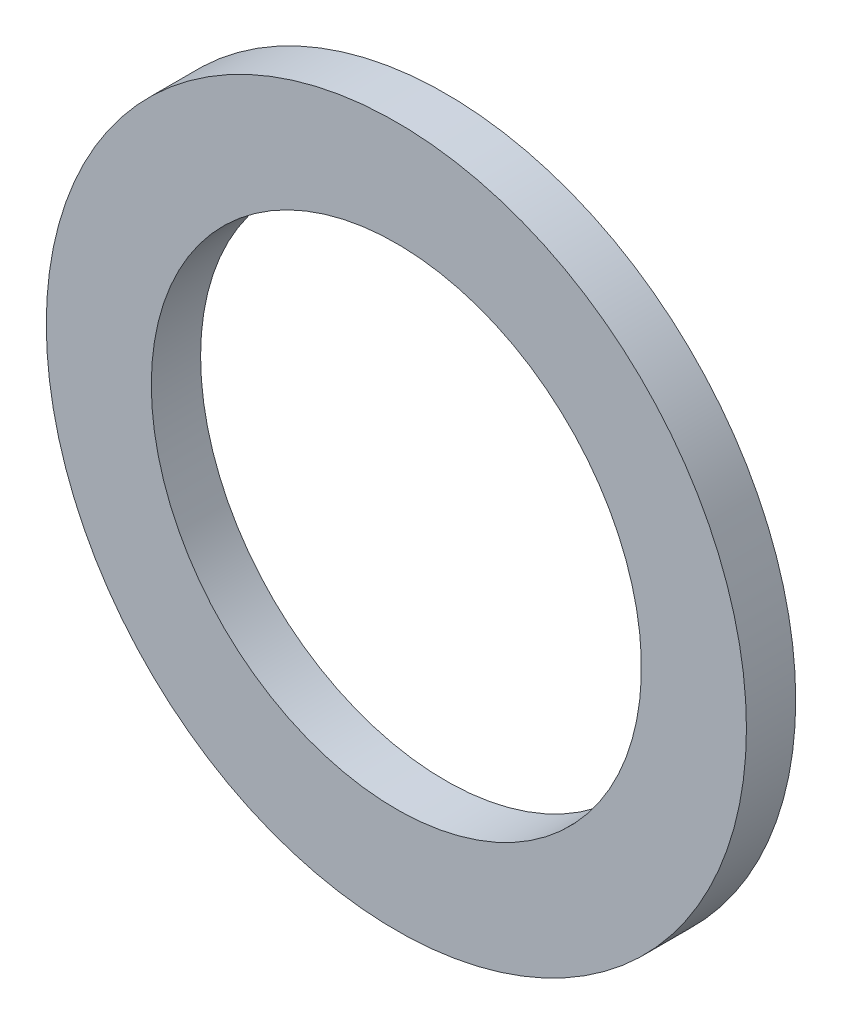
ISO-10303-21;
HEADER;
FILE_DESCRIPTION(('STEP AP214'),'2;1');
FILE_NAME('part.step','',(''),(''),'','','');
FILE_SCHEMA(('AUTOMOTIVE_DESIGN { 1 0 10303 214 1 1 1 1 }'));
ENDSEC;
DATA;
#1=APPLICATION_CONTEXT('core data for automotive mechanical design processes');
#2=APPLICATION_PROTOCOL_DEFINITION('international standard','automotive_design',2000,#1);
#3=PRODUCT_CONTEXT('',#1,'mechanical');
#4=PRODUCT('Part','Part','',(#3));
#5=PRODUCT_RELATED_PRODUCT_CATEGORY('part','',(#4));
#6=PRODUCT_DEFINITION_FORMATION('','',#4);
#7=PRODUCT_DEFINITION_CONTEXT('part definition',#1,'design');
#8=PRODUCT_DEFINITION('design','',#6,#7);
#9=PRODUCT_DEFINITION_SHAPE('','',#8);
#10=(LENGTH_UNIT() NAMED_UNIT(*) SI_UNIT(.MILLI.,.METRE.));
#11=(NAMED_UNIT(*) PLANE_ANGLE_UNIT() SI_UNIT($,.RADIAN.));
#12=(NAMED_UNIT(*) SI_UNIT($,.STERADIAN.) SOLID_ANGLE_UNIT());
#13=UNCERTAINTY_MEASURE_WITH_UNIT(LENGTH_MEASURE(1.E-05),#10,'distance_accuracy_value','');
#14=(GEOMETRIC_REPRESENTATION_CONTEXT(3) GLOBAL_UNCERTAINTY_ASSIGNED_CONTEXT((#13)) GLOBAL_UNIT_ASSIGNED_CONTEXT((#10,
#11,#12)) REPRESENTATION_CONTEXT('',''));
#15=CARTESIAN_POINT('',(0.,0.,0.));
#16=DIRECTION('',(0.,0.,1.));
#17=DIRECTION('',(1.,0.,0.));
#18=AXIS2_PLACEMENT_3D('',#15,#16,#17);
#19=CARTESIAN_POINT('',(0.,0.,-0.5588));
#20=DIRECTION('',(0.,0.,1.));
#21=DIRECTION('',(1.,0.,0.));
#22=AXIS2_PLACEMENT_3D('',#19,#20,#21);
#23=PLANE('',#22);
#24=CARTESIAN_POINT('',(0.,0.,-0.5588));
#25=DIRECTION('',(0.,0.,-1.));
#26=DIRECTION('',(-1.,0.,0.));
#27=AXIS2_PLACEMENT_3D('',#24,#25,#26);
#28=CIRCLE('',#27,5.55625);
#29=CARTESIAN_POINT('',(-5.55625,0.,-0.5588));
#30=VERTEX_POINT('',#29);
#31=EDGE_CURVE('E27',#30,#30,#28,.F.);
#32=ORIENTED_EDGE('',*,*,#31,.T.);
#33=EDGE_LOOP('',(#32));
#34=FACE_BOUND('',#33,.T.);
#35=CARTESIAN_POINT('',(0.,0.,-0.5588));
#36=DIRECTION('',(0.,0.,-1.));
#37=DIRECTION('',(-1.,0.,0.));
#38=AXIS2_PLACEMENT_3D('',#35,#36,#37);
#39=CIRCLE('',#38,7.9375);
#40=CARTESIAN_POINT('',(-7.9375,0.,-0.5588));
#41=VERTEX_POINT('',#40);
#42=EDGE_CURVE('E18',#41,#41,#39,.F.);
#43=ORIENTED_EDGE('',*,*,#42,.F.);
#44=EDGE_LOOP('',(#43));
#45=FACE_BOUND('',#44,.T.);
#46=ADVANCED_FACE('F15',(#34,#45),#23,.F.);
#47=CARTESIAN_POINT('',(0.,0.,0.5588));
#48=DIRECTION('',(0.,0.,-1.));
#49=DIRECTION('',(-1.,0.,0.));
#50=AXIS2_PLACEMENT_3D('',#47,#48,#49);
#51=CYLINDRICAL_SURFACE('',#50,7.9375);
#52=ORIENTED_EDGE('',*,*,#42,.T.);
#53=EDGE_LOOP('',(#52));
#54=FACE_BOUND('',#53,.T.);
#55=CARTESIAN_POINT('',(0.,0.,0.5588));
#56=DIRECTION('',(0.,0.,-1.));
#57=DIRECTION('',(-1.,0.,0.));
#58=AXIS2_PLACEMENT_3D('',#55,#56,#57);
#59=CIRCLE('',#58,7.9375);
#60=CARTESIAN_POINT('',(-7.9375,0.,0.5588));
#61=VERTEX_POINT('',#60);
#62=EDGE_CURVE('E22',#61,#61,#59,.F.);
#63=ORIENTED_EDGE('',*,*,#62,.F.);
#64=EDGE_LOOP('',(#63));
#65=FACE_BOUND('',#64,.T.);
#66=ADVANCED_FACE('F35',(#54,#65),#51,.T.);
#67=CARTESIAN_POINT('',(0.,0.,0.5588));
#68=DIRECTION('',(0.,0.,-1.));
#69=DIRECTION('',(-1.,0.,0.));
#70=AXIS2_PLACEMENT_3D('',#67,#68,#69);
#71=CYLINDRICAL_SURFACE('',#70,5.55625);
#72=CARTESIAN_POINT('',(0.,0.,0.5588));
#73=DIRECTION('',(0.,0.,-1.));
#74=DIRECTION('',(-1.,0.,0.));
#75=AXIS2_PLACEMENT_3D('',#72,#73,#74);
#76=CIRCLE('',#75,5.55625);
#77=CARTESIAN_POINT('',(-5.55625,0.,0.5588));
#78=VERTEX_POINT('',#77);
#79=EDGE_CURVE('E10',#78,#78,#76,.T.);
#80=ORIENTED_EDGE('',*,*,#79,.F.);
#81=EDGE_LOOP('',(#80));
#82=FACE_BOUND('',#81,.T.);
#83=ORIENTED_EDGE('',*,*,#31,.F.);
#84=EDGE_LOOP('',(#83));
#85=FACE_BOUND('',#84,.T.);
#86=ADVANCED_FACE('F43',(#82,#85),#71,.F.);
#87=CARTESIAN_POINT('',(0.,0.,0.5588));
#88=DIRECTION('',(0.,0.,1.));
#89=DIRECTION('',(1.,0.,0.));
#90=AXIS2_PLACEMENT_3D('',#87,#88,#89);
#91=PLANE('',#90);
#92=ORIENTED_EDGE('',*,*,#79,.T.);
#93=EDGE_LOOP('',(#92));
#94=FACE_BOUND('',#93,.T.);
#95=ORIENTED_EDGE('',*,*,#62,.T.);
#96=EDGE_LOOP('',(#95));
#97=FACE_BOUND('',#96,.T.);
#98=ADVANCED_FACE('F44',(#94,#97),#91,.T.);
#99=CLOSED_SHELL('',(#46,#66,#86,#98));
#100=MANIFOLD_SOLID_BREP('B1',#99);
#101=ADVANCED_BREP_SHAPE_REPRESENTATION('',(#18,#100),#14);
#102=SHAPE_DEFINITION_REPRESENTATION(#9,#101);
ENDSEC;
END-ISO-10303-21;
